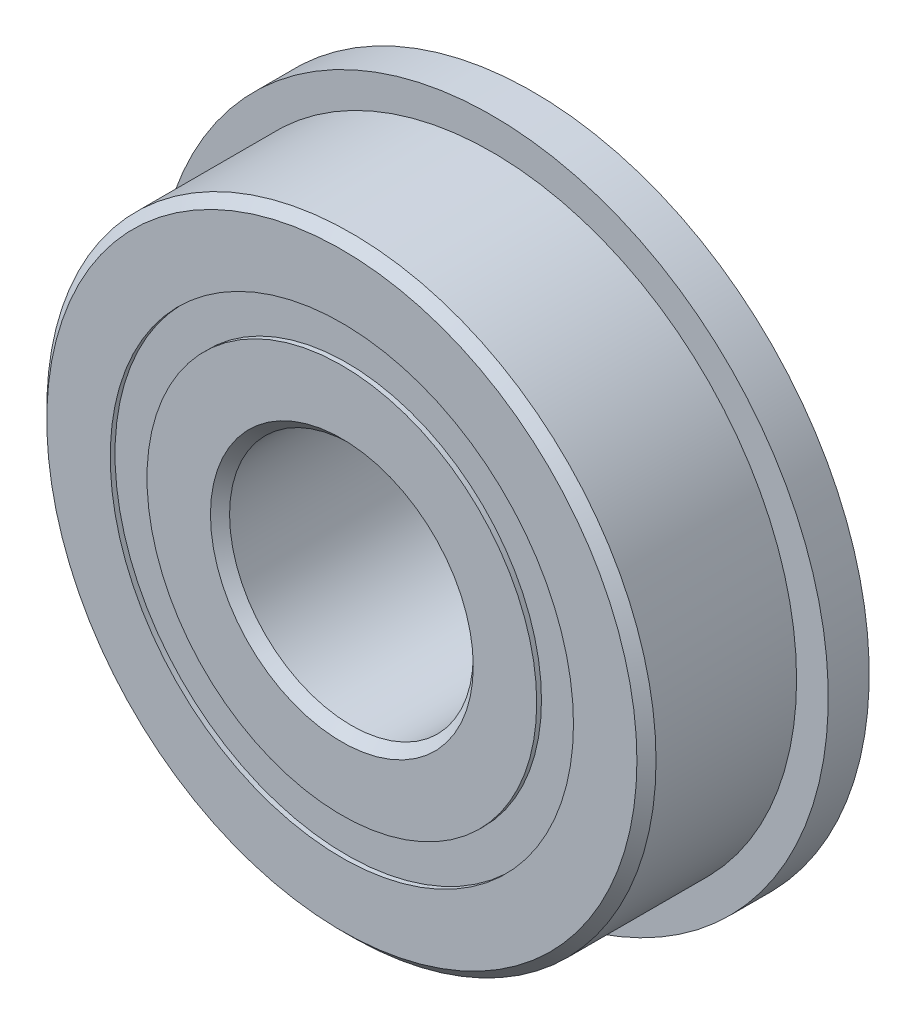
ISO-10303-21;
HEADER;
FILE_DESCRIPTION(('STEP AP214'),'2;1');
FILE_NAME('part.step','',(''),(''),'','','');
FILE_SCHEMA(('AUTOMOTIVE_DESIGN { 1 0 10303 214 1 1 1 1 }'));
ENDSEC;
DATA;
#1=APPLICATION_CONTEXT('core data for automotive mechanical design processes');
#2=APPLICATION_PROTOCOL_DEFINITION('international standard','automotive_design',2000,#1);
#3=PRODUCT_CONTEXT('',#1,'mechanical');
#4=PRODUCT('Part','Part','',(#3));
#5=PRODUCT_RELATED_PRODUCT_CATEGORY('part','',(#4));
#6=PRODUCT_DEFINITION_FORMATION('','',#4);
#7=PRODUCT_DEFINITION_CONTEXT('part definition',#1,'design');
#8=PRODUCT_DEFINITION('design','',#6,#7);
#9=PRODUCT_DEFINITION_SHAPE('','',#8);
#10=(LENGTH_UNIT() NAMED_UNIT(*) SI_UNIT(.MILLI.,.METRE.));
#11=(NAMED_UNIT(*) PLANE_ANGLE_UNIT() SI_UNIT($,.RADIAN.));
#12=(NAMED_UNIT(*) SI_UNIT($,.STERADIAN.) SOLID_ANGLE_UNIT());
#13=UNCERTAINTY_MEASURE_WITH_UNIT(LENGTH_MEASURE(1.E-05),#10,'distance_accuracy_value','');
#14=(GEOMETRIC_REPRESENTATION_CONTEXT(3) GLOBAL_UNCERTAINTY_ASSIGNED_CONTEXT((#13)) GLOBAL_UNIT_ASSIGNED_CONTEXT((#10,
#11,#12)) REPRESENTATION_CONTEXT('',''));
#15=CARTESIAN_POINT('',(0.,0.,0.));
#16=DIRECTION('',(0.,0.,1.));
#17=DIRECTION('',(1.,0.,0.));
#18=AXIS2_PLACEMENT_3D('',#15,#16,#17);
#19=CARTESIAN_POINT('',(0.,6.03522142857143,-2.36474));
#20=DIRECTION('',(0.,0.,1.));
#21=DIRECTION('',(1.,0.,0.));
#22=AXIS2_PLACEMENT_3D('',#19,#20,#21);
#23=PLANE('',#22);
#24=CARTESIAN_POINT('',(0.,0.,-2.36474));
#25=DIRECTION('',(0.,0.,1.));
#26=DIRECTION('',(1.,0.,0.));
#27=AXIS2_PLACEMENT_3D('',#24,#25,#26);
#28=CIRCLE('',#27,6.03522142857143);
#29=CARTESIAN_POINT('',(6.03522142857143,0.,-2.36474));
#30=VERTEX_POINT('',#29);
#31=EDGE_CURVE('E60',#30,#30,#28,.T.);
#32=ORIENTED_EDGE('',*,*,#31,.F.);
#33=EDGE_LOOP('',(#32));
#34=FACE_BOUND('',#33,.T.);
#35=CARTESIAN_POINT('',(0.,0.,-2.36474));
#36=DIRECTION('',(0.,0.,1.));
#37=DIRECTION('',(1.,0.,0.));
#38=AXIS2_PLACEMENT_3D('',#35,#36,#37);
#39=CIRCLE('',#38,5.07727857142857);
#40=CARTESIAN_POINT('',(5.07727857142857,0.,-2.36474));
#41=VERTEX_POINT('',#40);
#42=EDGE_CURVE('E11',#41,#41,#39,.T.);
#43=ORIENTED_EDGE('',*,*,#42,.T.);
#44=EDGE_LOOP('',(#43));
#45=FACE_BOUND('',#44,.T.);
#46=ADVANCED_FACE('F46',(#34,#45),#23,.F.);
#47=CARTESIAN_POINT('',(0.,0.,2.4892));
#48=DIRECTION('',(0.,0.,1.));
#49=DIRECTION('',(1.,0.,0.));
#50=AXIS2_PLACEMENT_3D('',#47,#48,#49);
#51=CYLINDRICAL_SURFACE('',#50,5.07727857142857);
#52=ORIENTED_EDGE('',*,*,#42,.F.);
#53=EDGE_LOOP('',(#52));
#54=FACE_BOUND('',#53,.T.);
#55=CARTESIAN_POINT('',(0.,0.,-1.20554465033679));
#56=DIRECTION('',(0.,0.,1.));
#57=DIRECTION('',(1.,0.,0.));
#58=AXIS2_PLACEMENT_3D('',#55,#56,#57);
#59=CIRCLE('',#58,5.07727857142857);
#60=CARTESIAN_POINT('',(5.07727857142857,0.,-1.20554465033679));
#61=VERTEX_POINT('',#60);
#62=EDGE_CURVE('E52',#61,#61,#59,.T.);
#63=ORIENTED_EDGE('',*,*,#62,.T.);
#64=EDGE_LOOP('',(#63));
#65=FACE_BOUND('',#64,.T.);
#66=ADVANCED_FACE('F69',(#54,#65),#51,.F.);
#67=CARTESIAN_POINT('',(0.,6.03522142857143,-1.20554465033679));
#68=DIRECTION('',(0.,0.,-1.));
#69=DIRECTION('',(-1.,0.,0.));
#70=AXIS2_PLACEMENT_3D('',#67,#68,#69);
#71=PLANE('',#70);
#72=ORIENTED_EDGE('',*,*,#62,.F.);
#73=EDGE_LOOP('',(#72));
#74=FACE_BOUND('',#73,.T.);
#75=CARTESIAN_POINT('',(0.,0.,-1.20554465033679));
#76=DIRECTION('',(0.,0.,1.));
#77=DIRECTION('',(1.,0.,0.));
#78=AXIS2_PLACEMENT_3D('',#75,#76,#77);
#79=CIRCLE('',#78,6.03522142857143);
#80=CARTESIAN_POINT('',(6.03522142857143,0.,-1.20554465033679));
#81=VERTEX_POINT('',#80);
#82=EDGE_CURVE('E56',#81,#81,#79,.T.);
#83=ORIENTED_EDGE('',*,*,#82,.T.);
#84=EDGE_LOOP('',(#83));
#85=FACE_BOUND('',#84,.T.);
#86=ADVANCED_FACE('F73',(#74,#85),#71,.F.);
#87=CARTESIAN_POINT('',(0.,0.,2.4892));
#88=DIRECTION('',(0.,0.,1.));
#89=DIRECTION('',(1.,0.,0.));
#90=AXIS2_PLACEMENT_3D('',#87,#88,#89);
#91=CYLINDRICAL_SURFACE('',#90,6.03522142857143);
#92=ORIENTED_EDGE('',*,*,#82,.F.);
#93=EDGE_LOOP('',(#92));
#94=FACE_BOUND('',#93,.T.);
#95=ORIENTED_EDGE('',*,*,#31,.T.);
#96=EDGE_LOOP('',(#95));
#97=FACE_BOUND('',#96,.T.);
#98=ADVANCED_FACE('F66',(#94,#97),#91,.T.);
#99=CLOSED_SHELL('',(#46,#66,#86,#98));
#100=MANIFOLD_SOLID_BREP('B2',#99);
#101=CARTESIAN_POINT('',(0.,6.03522142857143,2.36474));
#102=DIRECTION('',(0.,0.,-1.));
#103=DIRECTION('',(-1.,0.,0.));
#104=AXIS2_PLACEMENT_3D('',#101,#102,#103);
#105=PLANE('',#104);
#106=CARTESIAN_POINT('',(0.,0.,2.36474));
#107=DIRECTION('',(0.,0.,1.));
#108=DIRECTION('',(1.,0.,0.));
#109=AXIS2_PLACEMENT_3D('',#106,#107,#108);
#110=CIRCLE('',#109,5.07727857142857);
#111=CARTESIAN_POINT('',(5.07727857142857,0.,2.36474));
#112=VERTEX_POINT('',#111);
#113=EDGE_CURVE('E45',#112,#112,#110,.T.);
#114=ORIENTED_EDGE('',*,*,#113,.F.);
#115=EDGE_LOOP('',(#114));
#116=FACE_BOUND('',#115,.T.);
#117=CARTESIAN_POINT('',(0.,0.,2.36474));
#118=DIRECTION('',(0.,0.,1.));
#119=DIRECTION('',(1.,0.,0.));
#120=AXIS2_PLACEMENT_3D('',#117,#118,#119);
#121=CIRCLE('',#120,6.03522142857143);
#122=CARTESIAN_POINT('',(6.03522142857143,0.,2.36474));
#123=VERTEX_POINT('',#122);
#124=EDGE_CURVE('E128',#123,#123,#121,.T.);
#125=ORIENTED_EDGE('',*,*,#124,.T.);
#126=EDGE_LOOP('',(#125));
#127=FACE_BOUND('',#126,.T.);
#128=ADVANCED_FACE('F114',(#116,#127),#105,.F.);
#129=CARTESIAN_POINT('',(0.,0.,2.4892));
#130=DIRECTION('',(0.,0.,1.));
#131=DIRECTION('',(1.,0.,0.));
#132=AXIS2_PLACEMENT_3D('',#129,#130,#131);
#133=CYLINDRICAL_SURFACE('',#132,5.07727857142857);
#134=CARTESIAN_POINT('',(0.,0.,1.20554465033679));
#135=DIRECTION('',(0.,0.,1.));
#136=DIRECTION('',(1.,0.,0.));
#137=AXIS2_PLACEMENT_3D('',#134,#135,#136);
#138=CIRCLE('',#137,5.07727857142857);
#139=CARTESIAN_POINT('',(5.07727857142857,0.,1.20554465033679));
#140=VERTEX_POINT('',#139);
#141=EDGE_CURVE('E120',#140,#140,#138,.T.);
#142=ORIENTED_EDGE('',*,*,#141,.F.);
#143=EDGE_LOOP('',(#142));
#144=FACE_BOUND('',#143,.T.);
#145=ORIENTED_EDGE('',*,*,#113,.T.);
#146=EDGE_LOOP('',(#145));
#147=FACE_BOUND('',#146,.T.);
#148=ADVANCED_FACE('F143',(#144,#147),#133,.F.);
#149=CARTESIAN_POINT('',(0.,6.03522142857143,1.20554465033679));
#150=DIRECTION('',(0.,0.,1.));
#151=DIRECTION('',(1.,0.,0.));
#152=AXIS2_PLACEMENT_3D('',#149,#150,#151);
#153=PLANE('',#152);
#154=CARTESIAN_POINT('',(0.,0.,1.20554465033679));
#155=DIRECTION('',(0.,0.,1.));
#156=DIRECTION('',(1.,0.,0.));
#157=AXIS2_PLACEMENT_3D('',#154,#155,#156);
#158=CIRCLE('',#157,6.03522142857143);
#159=CARTESIAN_POINT('',(6.03522142857143,0.,1.20554465033679));
#160=VERTEX_POINT('',#159);
#161=EDGE_CURVE('E124',#160,#160,#158,.T.);
#162=ORIENTED_EDGE('',*,*,#161,.F.);
#163=EDGE_LOOP('',(#162));
#164=FACE_BOUND('',#163,.T.);
#165=ORIENTED_EDGE('',*,*,#141,.T.);
#166=EDGE_LOOP('',(#165));
#167=FACE_BOUND('',#166,.T.);
#168=ADVANCED_FACE('F138',(#164,#167),#153,.F.);
#169=CARTESIAN_POINT('',(0.,0.,2.4892));
#170=DIRECTION('',(0.,0.,1.));
#171=DIRECTION('',(1.,0.,0.));
#172=AXIS2_PLACEMENT_3D('',#169,#170,#171);
#173=CYLINDRICAL_SURFACE('',#172,6.03522142857143);
#174=ORIENTED_EDGE('',*,*,#124,.F.);
#175=EDGE_LOOP('',(#174));
#176=FACE_BOUND('',#175,.T.);
#177=ORIENTED_EDGE('',*,*,#161,.T.);
#178=EDGE_LOOP('',(#177));
#179=FACE_BOUND('',#178,.T.);
#180=ADVANCED_FACE('F135',(#176,#179),#173,.T.);
#181=CLOSED_SHELL('',(#128,#148,#168,#180));
#182=MANIFOLD_SOLID_BREP('B6',#181);
#183=CARTESIAN_POINT('',(-2.77812499999994,4.81185364977732,0.));
#184=DIRECTION('',(0.,0.,1.));
#185=DIRECTION('',(-0.499999999999989,0.866025403784445,0.));
#186=AXIS2_PLACEMENT_3D('',#183,#184,#185);
#187=SPHERICAL_SURFACE('',#186,1.20554465033679);
#188=CARTESIAN_POINT('',(-2.77812499999994,4.81185364977732,1.20554465033679));
#189=VERTEX_POINT('',#188);
#190=VERTEX_LOOP('',#189);
#191=FACE_BOUND('',#190,.T.);
#192=ADVANCED_FACE('F181',(#191),#187,.T.);
#193=CLOSED_SHELL('',(#192));
#194=MANIFOLD_SOLID_BREP('B40',#193);
#195=CARTESIAN_POINT('',(-4.81185364977726,2.77812500000006,0.));
#196=DIRECTION('',(0.,0.,1.));
#197=DIRECTION('',(-0.866025403784433,0.50000000000001,0.));
#198=AXIS2_PLACEMENT_3D('',#195,#196,#197);
#199=SPHERICAL_SURFACE('',#198,1.20554465033679);
#200=CARTESIAN_POINT('',(-4.81185364977726,2.77812500000006,1.20554465033679));
#201=VERTEX_POINT('',#200);
#202=VERTEX_LOOP('',#201);
#203=FACE_BOUND('',#202,.T.);
#204=ADVANCED_FACE('F201',(#203),#199,.T.);
#205=CLOSED_SHELL('',(#204));
#206=MANIFOLD_SOLID_BREP('B110',#205);
#207=CARTESIAN_POINT('',(-5.55625,0.,0.));
#208=DIRECTION('',(0.,0.,1.));
#209=DIRECTION('',(-1.,0.,0.));
#210=AXIS2_PLACEMENT_3D('',#207,#208,#209);
#211=SPHERICAL_SURFACE('',#210,1.20554465033679);
#212=CARTESIAN_POINT('',(-5.55625,0.,1.20554465033679));
#213=VERTEX_POINT('',#212);
#214=VERTEX_LOOP('',#213);
#215=FACE_BOUND('',#214,.T.);
#216=ADVANCED_FACE('F221',(#215),#211,.T.);
#217=CLOSED_SHELL('',(#216));
#218=MANIFOLD_SOLID_BREP('B177',#217);
#219=CARTESIAN_POINT('',(-4.81185364977731,-2.77812499999996,0.));
#220=DIRECTION('',(0.,0.,1.));
#221=DIRECTION('',(-0.866025403784443,-0.499999999999992,0.));
#222=AXIS2_PLACEMENT_3D('',#219,#220,#221);
#223=SPHERICAL_SURFACE('',#222,1.20554465033679);
#224=CARTESIAN_POINT('',(-4.81185364977731,-2.77812499999996,1.20554465033679));
#225=VERTEX_POINT('',#224);
#226=VERTEX_LOOP('',#225);
#227=FACE_BOUND('',#226,.T.);
#228=ADVANCED_FACE('F241',(#227),#223,.T.);
#229=CLOSED_SHELL('',(#228));
#230=MANIFOLD_SOLID_BREP('B197',#229);
#231=CARTESIAN_POINT('',(-2.77812500000004,-4.81185364977727,0.));
#232=DIRECTION('',(0.,0.,1.));
#233=DIRECTION('',(-0.500000000000007,-0.866025403784435,0.));
#234=AXIS2_PLACEMENT_3D('',#231,#232,#233);
#235=SPHERICAL_SURFACE('',#234,1.20554465033679);
#236=CARTESIAN_POINT('',(-2.77812500000004,-4.81185364977727,1.20554465033679));
#237=VERTEX_POINT('',#236);
#238=VERTEX_LOOP('',#237);
#239=FACE_BOUND('',#238,.T.);
#240=ADVANCED_FACE('F261',(#239),#235,.T.);
#241=CLOSED_SHELL('',(#240));
#242=MANIFOLD_SOLID_BREP('B217',#241);
#243=CARTESIAN_POINT('',(0.,-5.55625,0.));
#244=DIRECTION('',(0.,0.,1.));
#245=DIRECTION('',(0.,-1.,0.));
#246=AXIS2_PLACEMENT_3D('',#243,#244,#245);
#247=SPHERICAL_SURFACE('',#246,1.20554465033679);
#248=CARTESIAN_POINT('',(0.,-5.55625,1.20554465033679));
#249=VERTEX_POINT('',#248);
#250=VERTEX_LOOP('',#249);
#251=FACE_BOUND('',#250,.T.);
#252=ADVANCED_FACE('F281',(#251),#247,.T.);
#253=CLOSED_SHELL('',(#252));
#254=MANIFOLD_SOLID_BREP('B237',#253);
#255=CARTESIAN_POINT('',(2.77812499999997,-4.8118536497773,0.));
#256=DIRECTION('',(0.,0.,1.));
#257=DIRECTION('',(0.499999999999995,-0.866025403784442,0.));
#258=AXIS2_PLACEMENT_3D('',#255,#256,#257);
#259=SPHERICAL_SURFACE('',#258,1.20554465033679);
#260=CARTESIAN_POINT('',(2.77812499999997,-4.8118536497773,1.20554465033679));
#261=VERTEX_POINT('',#260);
#262=VERTEX_LOOP('',#261);
#263=FACE_BOUND('',#262,.T.);
#264=ADVANCED_FACE('F301',(#263),#259,.T.);
#265=CLOSED_SHELL('',(#264));
#266=MANIFOLD_SOLID_BREP('B257',#265);
#267=CARTESIAN_POINT('',(4.81185364977728,-2.77812500000002,0.));
#268=DIRECTION('',(0.,0.,1.));
#269=DIRECTION('',(0.866025403784436,-0.500000000000004,0.));
#270=AXIS2_PLACEMENT_3D('',#267,#268,#269);
#271=SPHERICAL_SURFACE('',#270,1.20554465033679);
#272=CARTESIAN_POINT('',(4.81185364977728,-2.77812500000002,1.20554465033679));
#273=VERTEX_POINT('',#272);
#274=VERTEX_LOOP('',#273);
#275=FACE_BOUND('',#274,.T.);
#276=ADVANCED_FACE('F321',(#275),#271,.T.);
#277=CLOSED_SHELL('',(#276));
#278=MANIFOLD_SOLID_BREP('B277',#277);
#279=CARTESIAN_POINT('',(5.55625,0.,0.));
#280=DIRECTION('',(0.,0.,1.));
#281=DIRECTION('',(1.,0.,0.));
#282=AXIS2_PLACEMENT_3D('',#279,#280,#281);
#283=SPHERICAL_SURFACE('',#282,1.20554465033679);
#284=CARTESIAN_POINT('',(5.55625,0.,1.20554465033679));
#285=VERTEX_POINT('',#284);
#286=VERTEX_LOOP('',#285);
#287=FACE_BOUND('',#286,.T.);
#288=ADVANCED_FACE('F341',(#287),#283,.T.);
#289=CLOSED_SHELL('',(#288));
#290=MANIFOLD_SOLID_BREP('B297',#289);
#291=CARTESIAN_POINT('',(4.81185364977729,2.77812499999999,0.));
#292=DIRECTION('',(0.,0.,1.));
#293=DIRECTION('',(0.86602540378444,0.499999999999998,0.));
#294=AXIS2_PLACEMENT_3D('',#291,#292,#293);
#295=SPHERICAL_SURFACE('',#294,1.20554465033679);
#296=CARTESIAN_POINT('',(4.81185364977729,2.77812499999999,1.20554465033679));
#297=VERTEX_POINT('',#296);
#298=VERTEX_LOOP('',#297);
#299=FACE_BOUND('',#298,.T.);
#300=ADVANCED_FACE('F361',(#299),#295,.T.);
#301=CLOSED_SHELL('',(#300));
#302=MANIFOLD_SOLID_BREP('B317',#301);
#303=CARTESIAN_POINT('',(2.77812500000001,4.81185364977728,0.));
#304=DIRECTION('',(0.,0.,1.));
#305=DIRECTION('',(0.500000000000001,0.866025403784438,0.));
#306=AXIS2_PLACEMENT_3D('',#303,#304,#305);
#307=SPHERICAL_SURFACE('',#306,1.20554465033679);
#308=CARTESIAN_POINT('',(2.77812500000001,4.81185364977728,1.20554465033679));
#309=VERTEX_POINT('',#308);
#310=VERTEX_LOOP('',#309);
#311=FACE_BOUND('',#310,.T.);
#312=ADVANCED_FACE('F381',(#311),#307,.T.);
#313=CLOSED_SHELL('',(#312));
#314=MANIFOLD_SOLID_BREP('B337',#313);
#315=CARTESIAN_POINT('',(0.,5.55625,0.));
#316=DIRECTION('',(0.,0.,1.));
#317=DIRECTION('',(0.,1.,0.));
#318=AXIS2_PLACEMENT_3D('',#315,#316,#317);
#319=SPHERICAL_SURFACE('',#318,1.20554465033679);
#320=CARTESIAN_POINT('',(0.,5.55625,1.20554465033679));
#321=VERTEX_POINT('',#320);
#322=VERTEX_LOOP('',#321);
#323=FACE_BOUND('',#322,.T.);
#324=ADVANCED_FACE('F404',(#323),#319,.T.);
#325=CLOSED_SHELL('',(#324));
#326=MANIFOLD_SOLID_BREP('B357',#325);
#327=CARTESIAN_POINT('',(0.,5.07727857142857,2.4892));
#328=DIRECTION('',(0.,0.,-1.));
#329=DIRECTION('',(-1.,0.,0.));
#330=AXIS2_PLACEMENT_3D('',#327,#328,#329);
#331=PLANE('',#330);
#332=CARTESIAN_POINT('',(0.,0.,2.4892));
#333=DIRECTION('',(0.,0.,1.));
#334=DIRECTION('',(1.,0.,0.));
#335=AXIS2_PLACEMENT_3D('',#332,#333,#334);
#336=CIRCLE('',#335,3.42392);
#337=CARTESIAN_POINT('',(3.42392,0.,2.4892));
#338=VERTEX_POINT('',#337);
#339=EDGE_CURVE('E452',#338,#338,#336,.T.);
#340=ORIENTED_EDGE('',*,*,#339,.F.);
#341=EDGE_LOOP('',(#340));
#342=FACE_BOUND('',#341,.T.);
#343=CARTESIAN_POINT('',(0.,0.,2.4892));
#344=DIRECTION('',(0.,0.,1.));
#345=DIRECTION('',(1.,0.,0.));
#346=AXIS2_PLACEMENT_3D('',#343,#344,#345);
#347=CIRCLE('',#346,5.07727857142857);
#348=CARTESIAN_POINT('',(5.07727857142857,0.,2.4892));
#349=VERTEX_POINT('',#348);
#350=EDGE_CURVE('E403',#349,#349,#347,.T.);
#351=ORIENTED_EDGE('',*,*,#350,.T.);
#352=EDGE_LOOP('',(#351));
#353=FACE_BOUND('',#352,.T.);
#354=ADVANCED_FACE('F424',(#342,#353),#331,.F.);
#355=CARTESIAN_POINT('',(0.,0.,2.4892));
#356=DIRECTION('',(0.,0.,1.));
#357=DIRECTION('',(1.,0.,0.));
#358=AXIS2_PLACEMENT_3D('',#355,#356,#357);
#359=CYLINDRICAL_SURFACE('',#358,5.07727857142857);
#360=ORIENTED_EDGE('',*,*,#350,.F.);
#361=EDGE_LOOP('',(#360));
#362=FACE_BOUND('',#361,.T.);
#363=CARTESIAN_POINT('',(0.,0.,1.10631111111111));
#364=DIRECTION('',(0.,0.,1.));
#365=DIRECTION('',(1.,0.,0.));
#366=AXIS2_PLACEMENT_3D('',#363,#364,#365);
#367=CIRCLE('',#366,5.07727857142857);
#368=CARTESIAN_POINT('',(5.07727857142857,0.,1.10631111111111));
#369=VERTEX_POINT('',#368);
#370=EDGE_CURVE('E430',#369,#369,#367,.T.);
#371=ORIENTED_EDGE('',*,*,#370,.T.);
#372=EDGE_LOOP('',(#371));
#373=FACE_BOUND('',#372,.T.);
#374=ADVANCED_FACE('F459',(#362,#373),#359,.T.);
#375=CARTESIAN_POINT('',(0.,0.,0.));
#376=DIRECTION('',(0.,0.,1.));
#377=DIRECTION('',(1.,0.,0.));
#378=AXIS2_PLACEMENT_3D('',#375,#376,#377);
#379=TOROIDAL_SURFACE('',#378,5.55625,1.20554465033679);
#380=ORIENTED_EDGE('',*,*,#370,.F.);
#381=EDGE_LOOP('',(#380));
#382=FACE_BOUND('',#381,.T.);
#383=CARTESIAN_POINT('',(0.,0.,-1.10631111111111));
#384=DIRECTION('',(0.,0.,1.));
#385=DIRECTION('',(1.,0.,0.));
#386=AXIS2_PLACEMENT_3D('',#383,#384,#385);
#387=CIRCLE('',#386,5.07727857142857);
#388=CARTESIAN_POINT('',(5.07727857142857,0.,-1.10631111111111));
#389=VERTEX_POINT('',#388);
#390=EDGE_CURVE('E434',#389,#389,#387,.T.);
#391=ORIENTED_EDGE('',*,*,#390,.T.);
#392=EDGE_LOOP('',(#391));
#393=FACE_BOUND('',#392,.T.);
#394=ADVANCED_FACE('F463',(#382,#393),#379,.F.);
#395=CARTESIAN_POINT('',(0.,0.,2.4892));
#396=DIRECTION('',(0.,0.,1.));
#397=DIRECTION('',(1.,0.,0.));
#398=AXIS2_PLACEMENT_3D('',#395,#396,#397);
#399=CYLINDRICAL_SURFACE('',#398,5.07727857142857);
#400=ORIENTED_EDGE('',*,*,#390,.F.);
#401=EDGE_LOOP('',(#400));
#402=FACE_BOUND('',#401,.T.);
#403=CARTESIAN_POINT('',(0.,0.,-2.4892));
#404=DIRECTION('',(0.,0.,1.));
#405=DIRECTION('',(1.,0.,0.));
#406=AXIS2_PLACEMENT_3D('',#403,#404,#405);
#407=CIRCLE('',#406,5.07727857142857);
#408=CARTESIAN_POINT('',(5.07727857142857,0.,-2.4892));
#409=VERTEX_POINT('',#408);
#410=EDGE_CURVE('E438',#409,#409,#407,.T.);
#411=ORIENTED_EDGE('',*,*,#410,.T.);
#412=EDGE_LOOP('',(#411));
#413=FACE_BOUND('',#412,.T.);
#414=ADVANCED_FACE('F468',(#402,#413),#399,.T.);
#415=CARTESIAN_POINT('',(0.,3.42392,-2.4892));
#416=DIRECTION('',(0.,0.,1.));
#417=DIRECTION('',(1.,0.,0.));
#418=AXIS2_PLACEMENT_3D('',#415,#416,#417);
#419=PLANE('',#418);
#420=ORIENTED_EDGE('',*,*,#410,.F.);
#421=EDGE_LOOP('',(#420));
#422=FACE_BOUND('',#421,.T.);
#423=CARTESIAN_POINT('',(0.,0.,-2.4892));
#424=DIRECTION('',(0.,0.,1.));
#425=DIRECTION('',(1.,0.,0.));
#426=AXIS2_PLACEMENT_3D('',#423,#424,#425);
#427=CIRCLE('',#426,3.42392);
#428=CARTESIAN_POINT('',(3.42392,0.,-2.4892));
#429=VERTEX_POINT('',#428);
#430=EDGE_CURVE('E443',#429,#429,#427,.T.);
#431=ORIENTED_EDGE('',*,*,#430,.T.);
#432=EDGE_LOOP('',(#431));
#433=FACE_BOUND('',#432,.T.);
#434=ADVANCED_FACE('F474',(#422,#433),#419,.F.);
#435=CARTESIAN_POINT('',(0.,0.,-2.24028));
#436=DIRECTION('',(0.,0.,-1.));
#437=DIRECTION('',(-1.,0.,0.));
#438=AXIS2_PLACEMENT_3D('',#435,#436,#437);
#439=CONICAL_SURFACE('',#438,3.175,0.785398163397448);
#440=ORIENTED_EDGE('',*,*,#430,.F.);
#441=EDGE_LOOP('',(#440));
#442=FACE_BOUND('',#441,.T.);
#443=CARTESIAN_POINT('',(0.,0.,-2.24028));
#444=DIRECTION('',(0.,0.,1.));
#445=DIRECTION('',(1.,0.,0.));
#446=AXIS2_PLACEMENT_3D('',#443,#444,#445);
#447=CIRCLE('',#446,3.175);
#448=CARTESIAN_POINT('',(3.175,0.,-2.24028));
#449=VERTEX_POINT('',#448);
#450=EDGE_CURVE('E446',#449,#449,#447,.T.);
#451=ORIENTED_EDGE('',*,*,#450,.T.);
#452=EDGE_LOOP('',(#451));
#453=FACE_BOUND('',#452,.T.);
#454=ADVANCED_FACE('F478',(#442,#453),#439,.F.);
#455=CARTESIAN_POINT('',(0.,0.,2.4892));
#456=DIRECTION('',(0.,0.,1.));
#457=DIRECTION('',(1.,0.,0.));
#458=AXIS2_PLACEMENT_3D('',#455,#456,#457);
#459=CYLINDRICAL_SURFACE('',#458,3.175);
#460=ORIENTED_EDGE('',*,*,#450,.F.);
#461=EDGE_LOOP('',(#460));
#462=FACE_BOUND('',#461,.T.);
#463=CARTESIAN_POINT('',(0.,0.,2.24028));
#464=DIRECTION('',(0.,0.,1.));
#465=DIRECTION('',(1.,0.,0.));
#466=AXIS2_PLACEMENT_3D('',#463,#464,#465);
#467=CIRCLE('',#466,3.175);
#468=CARTESIAN_POINT('',(3.175,0.,2.24028));
#469=VERTEX_POINT('',#468);
#470=EDGE_CURVE('E449',#469,#469,#467,.T.);
#471=ORIENTED_EDGE('',*,*,#470,.T.);
#472=EDGE_LOOP('',(#471));
#473=FACE_BOUND('',#472,.T.);
#474=ADVANCED_FACE('F482',(#462,#473),#459,.F.);
#475=CARTESIAN_POINT('',(0.,0.,2.4892));
#476=DIRECTION('',(0.,0.,1.));
#477=DIRECTION('',(1.,0.,0.));
#478=AXIS2_PLACEMENT_3D('',#475,#476,#477);
#479=CONICAL_SURFACE('',#478,3.42392,0.78539816339745);
#480=ORIENTED_EDGE('',*,*,#470,.F.);
#481=EDGE_LOOP('',(#480));
#482=FACE_BOUND('',#481,.T.);
#483=ORIENTED_EDGE('',*,*,#339,.T.);
#484=EDGE_LOOP('',(#483));
#485=FACE_BOUND('',#484,.T.);
#486=ADVANCED_FACE('F456',(#482,#485),#479,.F.);
#487=CLOSED_SHELL('',(#354,#374,#394,#414,#434,#454,#474,#486));
#488=MANIFOLD_SOLID_BREP('B377',#487);
#489=CARTESIAN_POINT('',(0.,0.,2.24028));
#490=DIRECTION('',(0.,0.,-1.));
#491=DIRECTION('',(-1.,0.,0.));
#492=AXIS2_PLACEMENT_3D('',#489,#490,#491);
#493=CONICAL_SURFACE('',#492,7.9375,0.785398163397448);
#494=CARTESIAN_POINT('',(0.,0.,2.4892));
#495=DIRECTION('',(0.,0.,1.));
#496=DIRECTION('',(1.,0.,0.));
#497=AXIS2_PLACEMENT_3D('',#494,#495,#496);
#498=CIRCLE('',#497,7.68858);
#499=CARTESIAN_POINT('',(7.68858,0.,2.4892));
#500=VERTEX_POINT('',#499);
#501=EDGE_CURVE('E568',#500,#500,#498,.T.);
#502=ORIENTED_EDGE('',*,*,#501,.F.);
#503=EDGE_LOOP('',(#502));
#504=FACE_BOUND('',#503,.T.);
#505=CARTESIAN_POINT('',(0.,0.,2.24028));
#506=DIRECTION('',(0.,0.,1.));
#507=DIRECTION('',(1.,0.,0.));
#508=AXIS2_PLACEMENT_3D('',#505,#506,#507);
#509=CIRCLE('',#508,7.9375);
#510=CARTESIAN_POINT('',(7.9375,0.,2.24028));
#511=VERTEX_POINT('',#510);
#512=EDGE_CURVE('E423',#511,#511,#509,.T.);
#513=ORIENTED_EDGE('',*,*,#512,.T.);
#514=EDGE_LOOP('',(#513));
#515=FACE_BOUND('',#514,.T.);
#516=ADVANCED_FACE('F546',(#504,#515),#493,.T.);
#517=CARTESIAN_POINT('',(0.,0.,2.4892));
#518=DIRECTION('',(0.,0.,1.));
#519=DIRECTION('',(1.,0.,0.));
#520=AXIS2_PLACEMENT_3D('',#517,#518,#519);
#521=CYLINDRICAL_SURFACE('',#520,7.9375);
#522=CARTESIAN_POINT('',(0.,0.,-1.4224));
#523=DIRECTION('',(0.,0.,1.));
#524=DIRECTION('',(1.,0.,0.));
#525=AXIS2_PLACEMENT_3D('',#522,#523,#524);
#526=CIRCLE('',#525,7.9375);
#527=CARTESIAN_POINT('',(7.9375,0.,-1.4224));
#528=VERTEX_POINT('',#527);
#529=EDGE_CURVE('E571',#528,#528,#526,.T.);
#530=ORIENTED_EDGE('',*,*,#529,.T.);
#531=EDGE_LOOP('',(#530));
#532=FACE_BOUND('',#531,.T.);
#533=ORIENTED_EDGE('',*,*,#512,.F.);
#534=EDGE_LOOP('',(#533));
#535=FACE_BOUND('',#534,.T.);
#536=ADVANCED_FACE('F591',(#532,#535),#521,.T.);
#537=CARTESIAN_POINT('',(0.,7.68858,-2.4892));
#538=DIRECTION('',(0.,0.,1.));
#539=DIRECTION('',(1.,0.,0.));
#540=AXIS2_PLACEMENT_3D('',#537,#538,#539);
#541=PLANE('',#540);
#542=CARTESIAN_POINT('',(0.,0.,-2.4892));
#543=DIRECTION('',(0.,0.,1.));
#544=DIRECTION('',(1.,0.,0.));
#545=AXIS2_PLACEMENT_3D('',#542,#543,#544);
#546=CIRCLE('',#545,6.03522142857143);
#547=CARTESIAN_POINT('',(6.03522142857143,0.,-2.4892));
#548=VERTEX_POINT('',#547);
#549=EDGE_CURVE('E552',#548,#548,#546,.T.);
#550=ORIENTED_EDGE('',*,*,#549,.T.);
#551=EDGE_LOOP('',(#550));
#552=FACE_BOUND('',#551,.T.);
#553=CARTESIAN_POINT('',(0.,0.,-2.4892));
#554=DIRECTION('',(0.,0.,-1.));
#555=DIRECTION('',(-1.,0.,0.));
#556=AXIS2_PLACEMENT_3D('',#553,#554,#555);
#557=CIRCLE('',#556,8.763);
#558=CARTESIAN_POINT('',(-8.763,0.,-2.4892));
#559=VERTEX_POINT('',#558);
#560=EDGE_CURVE('E574',#559,#559,#557,.T.);
#561=ORIENTED_EDGE('',*,*,#560,.T.);
#562=EDGE_LOOP('',(#561));
#563=FACE_BOUND('',#562,.T.);
#564=ADVANCED_FACE('F594',(#552,#563),#541,.F.);
#565=CARTESIAN_POINT('',(0.,0.,2.4892));
#566=DIRECTION('',(0.,0.,1.));
#567=DIRECTION('',(1.,0.,0.));
#568=AXIS2_PLACEMENT_3D('',#565,#566,#567);
#569=CYLINDRICAL_SURFACE('',#568,6.03522142857143);
#570=CARTESIAN_POINT('',(0.,0.,-1.10631111111111));
#571=DIRECTION('',(0.,0.,1.));
#572=DIRECTION('',(1.,0.,0.));
#573=AXIS2_PLACEMENT_3D('',#570,#571,#572);
#574=CIRCLE('',#573,6.03522142857143);
#575=CARTESIAN_POINT('',(6.03522142857143,0.,-1.10631111111111));
#576=VERTEX_POINT('',#575);
#577=EDGE_CURVE('E556',#576,#576,#574,.T.);
#578=ORIENTED_EDGE('',*,*,#577,.T.);
#579=EDGE_LOOP('',(#578));
#580=FACE_BOUND('',#579,.T.);
#581=ORIENTED_EDGE('',*,*,#549,.F.);
#582=EDGE_LOOP('',(#581));
#583=FACE_BOUND('',#582,.T.);
#584=ADVANCED_FACE('F599',(#580,#583),#569,.F.);
#585=CARTESIAN_POINT('',(0.,0.,0.));
#586=DIRECTION('',(0.,0.,1.));
#587=DIRECTION('',(1.,0.,0.));
#588=AXIS2_PLACEMENT_3D('',#585,#586,#587);
#589=TOROIDAL_SURFACE('',#588,5.55625,1.20554465033679);
#590=ORIENTED_EDGE('',*,*,#577,.F.);
#591=EDGE_LOOP('',(#590));
#592=FACE_BOUND('',#591,.T.);
#593=CARTESIAN_POINT('',(0.,0.,1.10631111111111));
#594=DIRECTION('',(0.,0.,1.));
#595=DIRECTION('',(1.,0.,0.));
#596=AXIS2_PLACEMENT_3D('',#593,#594,#595);
#597=CIRCLE('',#596,6.03522142857143);
#598=CARTESIAN_POINT('',(6.03522142857143,0.,1.10631111111111));
#599=VERTEX_POINT('',#598);
#600=EDGE_CURVE('E560',#599,#599,#597,.T.);
#601=ORIENTED_EDGE('',*,*,#600,.T.);
#602=EDGE_LOOP('',(#601));
#603=FACE_BOUND('',#602,.T.);
#604=ADVANCED_FACE('F605',(#592,#603),#589,.F.);
#605=CARTESIAN_POINT('',(0.,0.,2.4892));
#606=DIRECTION('',(0.,0.,1.));
#607=DIRECTION('',(1.,0.,0.));
#608=AXIS2_PLACEMENT_3D('',#605,#606,#607);
#609=CYLINDRICAL_SURFACE('',#608,6.03522142857143);
#610=ORIENTED_EDGE('',*,*,#600,.F.);
#611=EDGE_LOOP('',(#610));
#612=FACE_BOUND('',#611,.T.);
#613=CARTESIAN_POINT('',(0.,0.,2.4892));
#614=DIRECTION('',(0.,0.,1.));
#615=DIRECTION('',(1.,0.,0.));
#616=AXIS2_PLACEMENT_3D('',#613,#614,#615);
#617=CIRCLE('',#616,6.03522142857143);
#618=CARTESIAN_POINT('',(6.03522142857143,0.,2.4892));
#619=VERTEX_POINT('',#618);
#620=EDGE_CURVE('E565',#619,#619,#617,.T.);
#621=ORIENTED_EDGE('',*,*,#620,.T.);
#622=EDGE_LOOP('',(#621));
#623=FACE_BOUND('',#622,.T.);
#624=ADVANCED_FACE('F609',(#612,#623),#609,.F.);
#625=CARTESIAN_POINT('',(0.,7.68858,2.4892));
#626=DIRECTION('',(0.,0.,-1.));
#627=DIRECTION('',(-1.,0.,0.));
#628=AXIS2_PLACEMENT_3D('',#625,#626,#627);
#629=PLANE('',#628);
#630=ORIENTED_EDGE('',*,*,#620,.F.);
#631=EDGE_LOOP('',(#630));
#632=FACE_BOUND('',#631,.T.);
#633=ORIENTED_EDGE('',*,*,#501,.T.);
#634=EDGE_LOOP('',(#633));
#635=FACE_BOUND('',#634,.T.);
#636=ADVANCED_FACE('F587',(#632,#635),#629,.F.);
#637=CARTESIAN_POINT('',(0.,6.03522142857143,-1.4224));
#638=DIRECTION('',(0.,0.,1.));
#639=DIRECTION('',(1.,0.,0.));
#640=AXIS2_PLACEMENT_3D('',#637,#638,#639);
#641=PLANE('',#640);
#642=CARTESIAN_POINT('',(0.,0.,-1.4224));
#643=DIRECTION('',(0.,0.,-1.));
#644=DIRECTION('',(-1.,0.,0.));
#645=AXIS2_PLACEMENT_3D('',#642,#643,#644);
#646=CIRCLE('',#645,8.763);
#647=CARTESIAN_POINT('',(-8.763,0.,-1.4224));
#648=VERTEX_POINT('',#647);
#649=EDGE_CURVE('E577',#648,#648,#646,.T.);
#650=ORIENTED_EDGE('',*,*,#649,.F.);
#651=EDGE_LOOP('',(#650));
#652=FACE_BOUND('',#651,.T.);
#653=ORIENTED_EDGE('',*,*,#529,.F.);
#654=EDGE_LOOP('',(#653));
#655=FACE_BOUND('',#654,.T.);
#656=ADVANCED_FACE('F584',(#652,#655),#641,.T.);
#657=CARTESIAN_POINT('',(0.,0.,-2.4892));
#658=DIRECTION('',(0.,0.,-1.));
#659=DIRECTION('',(-1.,0.,0.));
#660=AXIS2_PLACEMENT_3D('',#657,#658,#659);
#661=CYLINDRICAL_SURFACE('',#660,8.763);
#662=ORIENTED_EDGE('',*,*,#649,.T.);
#663=EDGE_LOOP('',(#662));
#664=FACE_BOUND('',#663,.T.);
#665=ORIENTED_EDGE('',*,*,#560,.F.);
#666=EDGE_LOOP('',(#665));
#667=FACE_BOUND('',#666,.T.);
#668=ADVANCED_FACE('F581',(#664,#667),#661,.T.);
#669=CLOSED_SHELL('',(#516,#536,#564,#584,#604,#624,#636,#656,#668));
#670=MANIFOLD_SOLID_BREP('B398',#669);
#671=ADVANCED_BREP_SHAPE_REPRESENTATION('',(#18,#100,#182,#194,#206,#218,#230,#242,#254,#266,
#278,#290,#302,#314,#326,#488,#670),#14);
#672=SHAPE_DEFINITION_REPRESENTATION(#9,#671);
ENDSEC;
END-ISO-10303-21;
